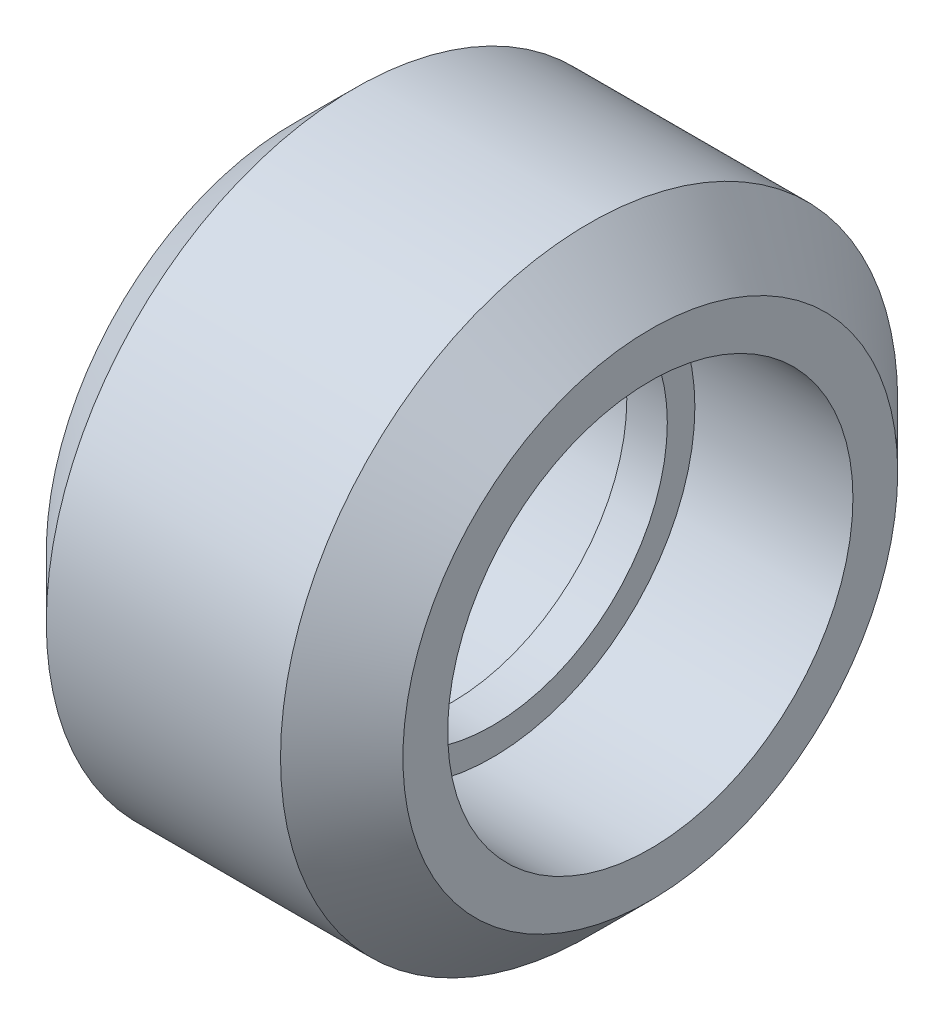
ISO-10303-21;
HEADER;
FILE_DESCRIPTION(('STEP AP214'),'2;1');
FILE_NAME('part.step','',(''),(''),'','','');
FILE_SCHEMA(('AUTOMOTIVE_DESIGN { 1 0 10303 214 1 1 1 1 }'));
ENDSEC;
DATA;
#1=APPLICATION_CONTEXT('core data for automotive mechanical design processes');
#2=APPLICATION_PROTOCOL_DEFINITION('international standard','automotive_design',2000,#1);
#3=PRODUCT_CONTEXT('',#1,'mechanical');
#4=PRODUCT('Part','Part','',(#3));
#5=PRODUCT_RELATED_PRODUCT_CATEGORY('part','',(#4));
#6=PRODUCT_DEFINITION_FORMATION('','',#4);
#7=PRODUCT_DEFINITION_CONTEXT('part definition',#1,'design');
#8=PRODUCT_DEFINITION('design','',#6,#7);
#9=PRODUCT_DEFINITION_SHAPE('','',#8);
#10=(LENGTH_UNIT() NAMED_UNIT(*) SI_UNIT(.MILLI.,.METRE.));
#11=(NAMED_UNIT(*) PLANE_ANGLE_UNIT() SI_UNIT($,.RADIAN.));
#12=(NAMED_UNIT(*) SI_UNIT($,.STERADIAN.) SOLID_ANGLE_UNIT());
#13=UNCERTAINTY_MEASURE_WITH_UNIT(LENGTH_MEASURE(1.E-05),#10,'distance_accuracy_value','');
#14=(GEOMETRIC_REPRESENTATION_CONTEXT(3) GLOBAL_UNCERTAINTY_ASSIGNED_CONTEXT((#13)) GLOBAL_UNIT_ASSIGNED_CONTEXT((#10,
#11,#12)) REPRESENTATION_CONTEXT('',''));
#15=CARTESIAN_POINT('',(0.,0.,0.));
#16=DIRECTION('',(0.,0.,1.));
#17=DIRECTION('',(1.,0.,0.));
#18=AXIS2_PLACEMENT_3D('',#15,#16,#17);
#19=CARTESIAN_POINT('',(-0.5,4.32,0.));
#20=DIRECTION('',(-1.,0.,0.));
#21=DIRECTION('',(0.,0.,1.));
#22=AXIS2_PLACEMENT_3D('',#19,#20,#21);
#23=PLANE('',#22);
#24=CARTESIAN_POINT('',(-0.5,0.,0.));
#25=DIRECTION('',(1.,0.,0.));
#26=DIRECTION('',(0.,0.,-1.));
#27=AXIS2_PLACEMENT_3D('',#24,#25,#26);
#28=CIRCLE('',#27,4.32);
#29=CARTESIAN_POINT('',(-0.5,0.,-4.32));
#30=VERTEX_POINT('',#29);
#31=EDGE_CURVE('E10',#30,#30,#28,.T.);
#32=ORIENTED_EDGE('',*,*,#31,.T.);
#33=EDGE_LOOP('',(#32));
#34=FACE_BOUND('',#33,.T.);
#35=CARTESIAN_POINT('',(-0.5,0.,0.));
#36=DIRECTION('',(1.,0.,0.));
#37=DIRECTION('',(0.,0.,-1.));
#38=AXIS2_PLACEMENT_3D('',#35,#36,#37);
#39=CIRCLE('',#38,5.);
#40=CARTESIAN_POINT('',(-0.5,0.,-5.));
#41=VERTEX_POINT('',#40);
#42=EDGE_CURVE('E70',#41,#41,#39,.T.);
#43=ORIENTED_EDGE('',*,*,#42,.F.);
#44=EDGE_LOOP('',(#43));
#45=FACE_BOUND('',#44,.T.);
#46=ADVANCED_FACE('F34',(#34,#45),#23,.T.);
#47=CARTESIAN_POINT('',(0.,0.,0.));
#48=DIRECTION('',(1.,0.,0.));
#49=DIRECTION('',(0.,0.,-1.));
#50=AXIS2_PLACEMENT_3D('',#47,#48,#49);
#51=CYLINDRICAL_SURFACE('',#50,4.32);
#52=CARTESIAN_POINT('',(0.5,0.,0.));
#53=DIRECTION('',(1.,0.,0.));
#54=DIRECTION('',(0.,0.,-1.));
#55=AXIS2_PLACEMENT_3D('',#52,#53,#54);
#56=CIRCLE('',#55,4.32);
#57=CARTESIAN_POINT('',(0.5,0.,-4.32));
#58=VERTEX_POINT('',#57);
#59=EDGE_CURVE('E40',#58,#58,#56,.T.);
#60=ORIENTED_EDGE('',*,*,#59,.T.);
#61=EDGE_LOOP('',(#60));
#62=FACE_BOUND('',#61,.T.);
#63=ORIENTED_EDGE('',*,*,#31,.F.);
#64=EDGE_LOOP('',(#63));
#65=FACE_BOUND('',#64,.T.);
#66=ADVANCED_FACE('F81',(#62,#65),#51,.F.);
#67=CARTESIAN_POINT('',(0.5,4.32,0.));
#68=DIRECTION('',(1.,0.,0.));
#69=DIRECTION('',(0.,0.,-1.));
#70=AXIS2_PLACEMENT_3D('',#67,#68,#69);
#71=PLANE('',#70);
#72=CARTESIAN_POINT('',(0.5,0.,0.));
#73=DIRECTION('',(1.,0.,0.));
#74=DIRECTION('',(0.,0.,-1.));
#75=AXIS2_PLACEMENT_3D('',#72,#73,#74);
#76=CIRCLE('',#75,5.);
#77=CARTESIAN_POINT('',(0.5,0.,-5.));
#78=VERTEX_POINT('',#77);
#79=EDGE_CURVE('E44',#78,#78,#76,.T.);
#80=ORIENTED_EDGE('',*,*,#79,.T.);
#81=EDGE_LOOP('',(#80));
#82=FACE_BOUND('',#81,.T.);
#83=ORIENTED_EDGE('',*,*,#59,.F.);
#84=EDGE_LOOP('',(#83));
#85=FACE_BOUND('',#84,.T.);
#86=ADVANCED_FACE('F85',(#82,#85),#71,.T.);
#87=CARTESIAN_POINT('',(0.,0.,0.));
#88=DIRECTION('',(1.,0.,0.));
#89=DIRECTION('',(0.,0.,-1.));
#90=AXIS2_PLACEMENT_3D('',#87,#88,#89);
#91=CYLINDRICAL_SURFACE('',#90,5.);
#92=CARTESIAN_POINT('',(4.4,0.,0.));
#93=DIRECTION('',(1.,0.,0.));
#94=DIRECTION('',(0.,0.,-1.));
#95=AXIS2_PLACEMENT_3D('',#92,#93,#94);
#96=CIRCLE('',#95,5.);
#97=CARTESIAN_POINT('',(4.4,0.,-5.));
#98=VERTEX_POINT('',#97);
#99=EDGE_CURVE('E48',#98,#98,#96,.T.);
#100=ORIENTED_EDGE('',*,*,#99,.T.);
#101=EDGE_LOOP('',(#100));
#102=FACE_BOUND('',#101,.T.);
#103=ORIENTED_EDGE('',*,*,#79,.F.);
#104=EDGE_LOOP('',(#103));
#105=FACE_BOUND('',#104,.T.);
#106=ADVANCED_FACE('F89',(#102,#105),#91,.F.);
#107=CARTESIAN_POINT('',(4.4,5.,0.));
#108=DIRECTION('',(1.,0.,0.));
#109=DIRECTION('',(0.,0.,-1.));
#110=AXIS2_PLACEMENT_3D('',#107,#108,#109);
#111=PLANE('',#110);
#112=CARTESIAN_POINT('',(4.4,0.,0.));
#113=DIRECTION('',(1.,0.,0.));
#114=DIRECTION('',(0.,0.,-1.));
#115=AXIS2_PLACEMENT_3D('',#112,#113,#114);
#116=CIRCLE('',#115,6.10500000000001);
#117=CARTESIAN_POINT('',(4.4,0.,-6.10500000000001));
#118=VERTEX_POINT('',#117);
#119=EDGE_CURVE('E53',#118,#118,#116,.T.);
#120=ORIENTED_EDGE('',*,*,#119,.T.);
#121=EDGE_LOOP('',(#120));
#122=FACE_BOUND('',#121,.T.);
#123=ORIENTED_EDGE('',*,*,#99,.F.);
#124=EDGE_LOOP('',(#123));
#125=FACE_BOUND('',#124,.T.);
#126=ADVANCED_FACE('F96',(#122,#125),#111,.T.);
#127=CARTESIAN_POINT('',(4.4,0.,0.));
#128=DIRECTION('',(-1.,0.,0.));
#129=DIRECTION('',(0.,0.,1.));
#130=AXIS2_PLACEMENT_3D('',#127,#128,#129);
#131=CONICAL_SURFACE('',#130,6.10500000000001,0.785398163397447);
#132=CARTESIAN_POINT('',(2.89,0.,0.));
#133=DIRECTION('',(1.,0.,0.));
#134=DIRECTION('',(0.,0.,-1.));
#135=AXIS2_PLACEMENT_3D('',#132,#133,#134);
#136=CIRCLE('',#135,7.615);
#137=CARTESIAN_POINT('',(2.89,0.,-7.615));
#138=VERTEX_POINT('',#137);
#139=EDGE_CURVE('E56',#138,#138,#136,.T.);
#140=ORIENTED_EDGE('',*,*,#139,.T.);
#141=EDGE_LOOP('',(#140));
#142=FACE_BOUND('',#141,.T.);
#143=ORIENTED_EDGE('',*,*,#119,.F.);
#144=EDGE_LOOP('',(#143));
#145=FACE_BOUND('',#144,.T.);
#146=ADVANCED_FACE('F100',(#142,#145),#131,.T.);
#147=CARTESIAN_POINT('',(0.,0.,0.));
#148=DIRECTION('',(1.,0.,0.));
#149=DIRECTION('',(0.,0.,-1.));
#150=AXIS2_PLACEMENT_3D('',#147,#148,#149);
#151=CYLINDRICAL_SURFACE('',#150,7.615);
#152=CARTESIAN_POINT('',(-2.89,0.,0.));
#153=DIRECTION('',(1.,0.,0.));
#154=DIRECTION('',(0.,0.,-1.));
#155=AXIS2_PLACEMENT_3D('',#152,#153,#154);
#156=CIRCLE('',#155,7.615);
#157=CARTESIAN_POINT('',(-2.89,0.,-7.615));
#158=VERTEX_POINT('',#157);
#159=EDGE_CURVE('E59',#158,#158,#156,.T.);
#160=ORIENTED_EDGE('',*,*,#159,.T.);
#161=EDGE_LOOP('',(#160));
#162=FACE_BOUND('',#161,.T.);
#163=ORIENTED_EDGE('',*,*,#139,.F.);
#164=EDGE_LOOP('',(#163));
#165=FACE_BOUND('',#164,.T.);
#166=ADVANCED_FACE('F104',(#162,#165),#151,.T.);
#167=CARTESIAN_POINT('',(-2.89,0.,0.));
#168=DIRECTION('',(1.,0.,0.));
#169=DIRECTION('',(0.,0.,-1.));
#170=AXIS2_PLACEMENT_3D('',#167,#168,#169);
#171=CONICAL_SURFACE('',#170,7.615,0.785398163397447);
#172=CARTESIAN_POINT('',(-4.4,0.,0.));
#173=DIRECTION('',(1.,0.,0.));
#174=DIRECTION('',(0.,0.,-1.));
#175=AXIS2_PLACEMENT_3D('',#172,#173,#174);
#176=CIRCLE('',#175,6.105);
#177=CARTESIAN_POINT('',(-4.4,0.,-6.105));
#178=VERTEX_POINT('',#177);
#179=EDGE_CURVE('E63',#178,#178,#176,.T.);
#180=ORIENTED_EDGE('',*,*,#179,.T.);
#181=EDGE_LOOP('',(#180));
#182=FACE_BOUND('',#181,.T.);
#183=ORIENTED_EDGE('',*,*,#159,.F.);
#184=EDGE_LOOP('',(#183));
#185=FACE_BOUND('',#184,.T.);
#186=ADVANCED_FACE('F108',(#182,#185),#171,.T.);
#187=CARTESIAN_POINT('',(-4.4,5.,0.));
#188=DIRECTION('',(-1.,0.,0.));
#189=DIRECTION('',(0.,0.,1.));
#190=AXIS2_PLACEMENT_3D('',#187,#188,#189);
#191=PLANE('',#190);
#192=CARTESIAN_POINT('',(-4.4,0.,0.));
#193=DIRECTION('',(1.,0.,0.));
#194=DIRECTION('',(0.,0.,-1.));
#195=AXIS2_PLACEMENT_3D('',#192,#193,#194);
#196=CIRCLE('',#195,5.);
#197=CARTESIAN_POINT('',(-4.4,0.,-5.));
#198=VERTEX_POINT('',#197);
#199=EDGE_CURVE('E67',#198,#198,#196,.T.);
#200=ORIENTED_EDGE('',*,*,#199,.T.);
#201=EDGE_LOOP('',(#200));
#202=FACE_BOUND('',#201,.T.);
#203=ORIENTED_EDGE('',*,*,#179,.F.);
#204=EDGE_LOOP('',(#203));
#205=FACE_BOUND('',#204,.T.);
#206=ADVANCED_FACE('F112',(#202,#205),#191,.T.);
#207=CARTESIAN_POINT('',(0.,0.,0.));
#208=DIRECTION('',(1.,0.,0.));
#209=DIRECTION('',(0.,0.,-1.));
#210=AXIS2_PLACEMENT_3D('',#207,#208,#209);
#211=CYLINDRICAL_SURFACE('',#210,5.);
#212=ORIENTED_EDGE('',*,*,#42,.T.);
#213=EDGE_LOOP('',(#212));
#214=FACE_BOUND('',#213,.T.);
#215=ORIENTED_EDGE('',*,*,#199,.F.);
#216=EDGE_LOOP('',(#215));
#217=FACE_BOUND('',#216,.T.);
#218=ADVANCED_FACE('F77',(#214,#217),#211,.F.);
#219=CLOSED_SHELL('',(#46,#66,#86,#106,#126,#146,#166,#186,#206,#218));
#220=MANIFOLD_SOLID_BREP('B2',#219);
#221=ADVANCED_BREP_SHAPE_REPRESENTATION('',(#18,#220),#14);
#222=SHAPE_DEFINITION_REPRESENTATION(#9,#221);
ENDSEC;
END-ISO-10303-21;
